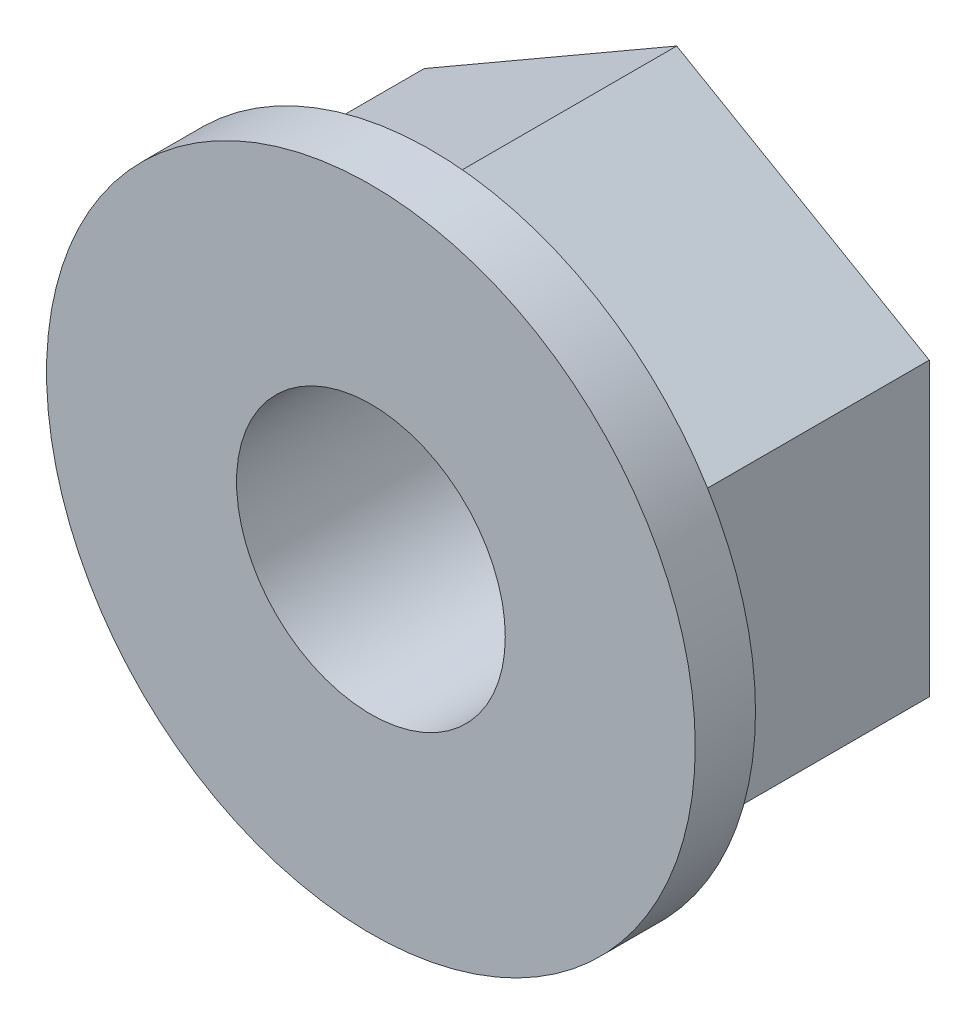
ISO-10303-21;
HEADER;
FILE_DESCRIPTION(('STEP AP214'),'2;1');
FILE_NAME('part.step','',(''),(''),'','','');
FILE_SCHEMA(('AUTOMOTIVE_DESIGN { 1 0 10303 214 1 1 1 1 }'));
ENDSEC;
DATA;
#1=APPLICATION_CONTEXT('core data for automotive mechanical design processes');
#2=APPLICATION_PROTOCOL_DEFINITION('international standard','automotive_design',2000,#1);
#3=PRODUCT_CONTEXT('',#1,'mechanical');
#4=PRODUCT('Part','Part','',(#3));
#5=PRODUCT_RELATED_PRODUCT_CATEGORY('part','',(#4));
#6=PRODUCT_DEFINITION_FORMATION('','',#4);
#7=PRODUCT_DEFINITION_CONTEXT('part definition',#1,'design');
#8=PRODUCT_DEFINITION('design','',#6,#7);
#9=PRODUCT_DEFINITION_SHAPE('','',#8);
#10=(LENGTH_UNIT() NAMED_UNIT(*) SI_UNIT(.MILLI.,.METRE.));
#11=(NAMED_UNIT(*) PLANE_ANGLE_UNIT() SI_UNIT($,.RADIAN.));
#12=(NAMED_UNIT(*) SI_UNIT($,.STERADIAN.) SOLID_ANGLE_UNIT());
#13=UNCERTAINTY_MEASURE_WITH_UNIT(LENGTH_MEASURE(1.E-05),#10,'distance_accuracy_value','');
#14=(GEOMETRIC_REPRESENTATION_CONTEXT(3) GLOBAL_UNCERTAINTY_ASSIGNED_CONTEXT((#13)) GLOBAL_UNIT_ASSIGNED_CONTEXT((#10,
#11,#12)) REPRESENTATION_CONTEXT('',''));
#15=CARTESIAN_POINT('',(0.,0.,0.));
#16=DIRECTION('',(0.,0.,1.));
#17=DIRECTION('',(1.,0.,0.));
#18=AXIS2_PLACEMENT_3D('',#15,#16,#17);
#19=CARTESIAN_POINT('',(5.45,0.,0.));
#20=DIRECTION('',(0.,0.,-1.));
#21=DIRECTION('',(-1.,0.,0.));
#22=AXIS2_PLACEMENT_3D('',#19,#20,#21);
#23=PLANE('',#22);
#24=DIRECTION('',(-0.866025403784439,0.5,0.));
#25=VECTOR('',#24,1.);
#26=CARTESIAN_POINT('',(2.725,1.57327948354173,0.));
#27=LINE('',#26,#25);
#28=CARTESIAN_POINT('',(2.725,1.57327948354173,0.));
#29=VERTEX_POINT('',#28);
#30=CARTESIAN_POINT('',(0.,3.14655896708346,0.));
#31=VERTEX_POINT('',#30);
#32=EDGE_CURVE('E130',#29,#31,#27,.T.);
#33=ORIENTED_EDGE('',*,*,#32,.F.);
#34=DIRECTION('',(0.,1.,0.));
#35=VECTOR('',#34,1.);
#36=CARTESIAN_POINT('',(2.725,-1.57327948354173,0.));
#37=LINE('',#36,#35);
#38=CARTESIAN_POINT('',(2.725,-1.57327948354173,0.));
#39=VERTEX_POINT('',#38);
#40=EDGE_CURVE('E92',#39,#29,#37,.T.);
#41=ORIENTED_EDGE('',*,*,#40,.F.);
#42=DIRECTION('',(0.866025403784439,0.5,0.));
#43=VECTOR('',#42,1.);
#44=CARTESIAN_POINT('',(0.,-3.14655896708346,0.));
#45=LINE('',#44,#43);
#46=CARTESIAN_POINT('',(0.,-3.14655896708346,0.));
#47=VERTEX_POINT('',#46);
#48=EDGE_CURVE('E128',#47,#39,#45,.T.);
#49=ORIENTED_EDGE('',*,*,#48,.F.);
#50=DIRECTION('',(0.866025403784438,-0.5,0.));
#51=VECTOR('',#50,1.);
#52=CARTESIAN_POINT('',(-2.725,-1.57327948354173,0.));
#53=LINE('',#52,#51);
#54=CARTESIAN_POINT('',(-2.725,-1.57327948354173,0.));
#55=VERTEX_POINT('',#54);
#56=EDGE_CURVE('E126',#55,#47,#53,.T.);
#57=ORIENTED_EDGE('',*,*,#56,.F.);
#58=DIRECTION('',(0.,-1.,0.));
#59=VECTOR('',#58,1.);
#60=CARTESIAN_POINT('',(-2.725,1.57327948354173,0.));
#61=LINE('',#60,#59);
#62=CARTESIAN_POINT('',(-2.725,1.57327948354173,0.));
#63=VERTEX_POINT('',#62);
#64=EDGE_CURVE('E117',#63,#55,#61,.T.);
#65=ORIENTED_EDGE('',*,*,#64,.F.);
#66=DIRECTION('',(-0.866025403784439,-0.5,0.));
#67=VECTOR('',#66,1.);
#68=CARTESIAN_POINT('',(0.,3.14655896708346,0.));
#69=LINE('',#68,#67);
#70=EDGE_CURVE('E124',#31,#63,#69,.T.);
#71=ORIENTED_EDGE('',*,*,#70,.F.);
#72=EDGE_LOOP('',(#33,#41,#49,#57,#65,#71));
#73=FACE_BOUND('',#72,.T.);
#74=CARTESIAN_POINT('',(0.,0.,0.));
#75=DIRECTION('',(0.,0.,1.));
#76=DIRECTION('',(1.,0.,0.));
#77=AXIS2_PLACEMENT_3D('',#74,#75,#76);
#78=CIRCLE('',#77,1.45);
#79=CARTESIAN_POINT('',(1.45,0.,0.));
#80=VERTEX_POINT('',#79);
#81=EDGE_CURVE('E139',#80,#80,#78,.T.);
#82=ORIENTED_EDGE('',*,*,#81,.T.);
#83=EDGE_LOOP('',(#82));
#84=FACE_BOUND('',#83,.T.);
#85=ADVANCED_FACE('F28',(#73,#84),#23,.T.);
#86=CARTESIAN_POINT('',(2.725,1.57327948354173,2.65));
#87=DIRECTION('',(-0.5,-0.866025403784439,0.));
#88=DIRECTION('',(0.866025403784439,-0.5,0.));
#89=AXIS2_PLACEMENT_3D('',#86,#87,#88);
#90=PLANE('',#89);
#91=ORIENTED_EDGE('',*,*,#32,.T.);
#92=DIRECTION('',(0.,0.,-1.));
#93=VECTOR('',#92,1.);
#94=CARTESIAN_POINT('',(0.,3.14655896708346,2.65));
#95=LINE('',#94,#93);
#96=CARTESIAN_POINT('',(0.,3.14655896708346,2.65));
#97=VERTEX_POINT('',#96);
#98=EDGE_CURVE('E11',#97,#31,#95,.T.);
#99=ORIENTED_EDGE('',*,*,#98,.F.);
#100=DIRECTION('',(-0.866025403784439,0.5,0.));
#101=VECTOR('',#100,1.);
#102=CARTESIAN_POINT('',(2.725,1.57327948354173,2.65));
#103=LINE('',#102,#101);
#104=CARTESIAN_POINT('',(2.725,1.57327948354173,2.65));
#105=VERTEX_POINT('',#104);
#106=EDGE_CURVE('E83',#105,#97,#103,.T.);
#107=ORIENTED_EDGE('',*,*,#106,.F.);
#108=DIRECTION('',(0.,0.,-1.));
#109=VECTOR('',#108,1.);
#110=CARTESIAN_POINT('',(2.725,1.57327948354173,2.65));
#111=LINE('',#110,#109);
#112=EDGE_CURVE('E86',#105,#29,#111,.T.);
#113=ORIENTED_EDGE('',*,*,#112,.T.);
#114=EDGE_LOOP('',(#91,#99,#107,#113));
#115=FACE_BOUND('',#114,.T.);
#116=ADVANCED_FACE('F30',(#115),#90,.F.);
#117=CARTESIAN_POINT('',(0.,3.14655896708346,2.65));
#118=DIRECTION('',(0.5,-0.866025403784439,0.));
#119=DIRECTION('',(0.866025403784439,0.5,0.));
#120=AXIS2_PLACEMENT_3D('',#117,#118,#119);
#121=PLANE('',#120);
#122=ORIENTED_EDGE('',*,*,#70,.T.);
#123=DIRECTION('',(0.,0.,-1.));
#124=VECTOR('',#123,1.);
#125=CARTESIAN_POINT('',(-2.725,1.57327948354173,2.65));
#126=LINE('',#125,#124);
#127=CARTESIAN_POINT('',(-2.725,1.57327948354173,2.65));
#128=VERTEX_POINT('',#127);
#129=EDGE_CURVE('E36',#128,#63,#126,.T.);
#130=ORIENTED_EDGE('',*,*,#129,.F.);
#131=DIRECTION('',(-0.866025403784439,-0.5,0.));
#132=VECTOR('',#131,1.);
#133=CARTESIAN_POINT('',(0.,3.14655896708346,2.65));
#134=LINE('',#133,#132);
#135=EDGE_CURVE('E91',#97,#128,#134,.T.);
#136=ORIENTED_EDGE('',*,*,#135,.F.);
#137=ORIENTED_EDGE('',*,*,#98,.T.);
#138=EDGE_LOOP('',(#122,#130,#136,#137));
#139=FACE_BOUND('',#138,.T.);
#140=ADVANCED_FACE('F173',(#139),#121,.F.);
#141=CARTESIAN_POINT('',(-2.725,1.57327948354173,2.65));
#142=DIRECTION('',(1.,0.,0.));
#143=DIRECTION('',(0.,1.,0.));
#144=AXIS2_PLACEMENT_3D('',#141,#142,#143);
#145=PLANE('',#144);
#146=ORIENTED_EDGE('',*,*,#64,.T.);
#147=DIRECTION('',(0.,0.,-1.));
#148=VECTOR('',#147,1.);
#149=CARTESIAN_POINT('',(-2.725,-1.57327948354173,2.65));
#150=LINE('',#149,#148);
#151=CARTESIAN_POINT('',(-2.725,-1.57327948354173,2.65));
#152=VERTEX_POINT('',#151);
#153=EDGE_CURVE('E110',#152,#55,#150,.T.);
#154=ORIENTED_EDGE('',*,*,#153,.F.);
#155=DIRECTION('',(0.,-1.,0.));
#156=VECTOR('',#155,1.);
#157=CARTESIAN_POINT('',(-2.725,1.57327948354173,2.65));
#158=LINE('',#157,#156);
#159=EDGE_CURVE('E119',#128,#152,#158,.T.);
#160=ORIENTED_EDGE('',*,*,#159,.F.);
#161=ORIENTED_EDGE('',*,*,#129,.T.);
#162=EDGE_LOOP('',(#146,#154,#160,#161));
#163=FACE_BOUND('',#162,.T.);
#164=ADVANCED_FACE('F116',(#163),#145,.F.);
#165=CARTESIAN_POINT('',(-2.725,-1.57327948354173,2.65));
#166=DIRECTION('',(0.5,0.866025403784438,0.));
#167=DIRECTION('',(-0.866025403784438,0.5,0.));
#168=AXIS2_PLACEMENT_3D('',#165,#166,#167);
#169=PLANE('',#168);
#170=ORIENTED_EDGE('',*,*,#56,.T.);
#171=DIRECTION('',(0.,0.,-1.));
#172=VECTOR('',#171,1.);
#173=CARTESIAN_POINT('',(0.,-3.14655896708346,2.65));
#174=LINE('',#173,#172);
#175=CARTESIAN_POINT('',(0.,-3.14655896708346,2.65));
#176=VERTEX_POINT('',#175);
#177=EDGE_CURVE('E51',#176,#47,#174,.T.);
#178=ORIENTED_EDGE('',*,*,#177,.F.);
#179=DIRECTION('',(0.866025403784438,-0.5,0.));
#180=VECTOR('',#179,1.);
#181=CARTESIAN_POINT('',(-2.725,-1.57327948354173,2.65));
#182=LINE('',#181,#180);
#183=EDGE_CURVE('E104',#152,#176,#182,.T.);
#184=ORIENTED_EDGE('',*,*,#183,.F.);
#185=ORIENTED_EDGE('',*,*,#153,.T.);
#186=EDGE_LOOP('',(#170,#178,#184,#185));
#187=FACE_BOUND('',#186,.T.);
#188=ADVANCED_FACE('F137',(#187),#169,.F.);
#189=CARTESIAN_POINT('',(0.,-3.14655896708346,2.65));
#190=DIRECTION('',(-0.5,0.866025403784439,0.));
#191=DIRECTION('',(-0.866025403784439,-0.5,0.));
#192=AXIS2_PLACEMENT_3D('',#189,#190,#191);
#193=PLANE('',#192);
#194=ORIENTED_EDGE('',*,*,#48,.T.);
#195=DIRECTION('',(0.,0.,-1.));
#196=VECTOR('',#195,1.);
#197=CARTESIAN_POINT('',(2.725,-1.57327948354173,2.65));
#198=LINE('',#197,#196);
#199=CARTESIAN_POINT('',(2.725,-1.57327948354173,2.65));
#200=VERTEX_POINT('',#199);
#201=EDGE_CURVE('E43',#200,#39,#198,.T.);
#202=ORIENTED_EDGE('',*,*,#201,.F.);
#203=DIRECTION('',(0.866025403784439,0.5,0.));
#204=VECTOR('',#203,1.);
#205=CARTESIAN_POINT('',(0.,-3.14655896708346,2.65));
#206=LINE('',#205,#204);
#207=EDGE_CURVE('E102',#176,#200,#206,.T.);
#208=ORIENTED_EDGE('',*,*,#207,.F.);
#209=ORIENTED_EDGE('',*,*,#177,.T.);
#210=EDGE_LOOP('',(#194,#202,#208,#209));
#211=FACE_BOUND('',#210,.T.);
#212=ADVANCED_FACE('F138',(#211),#193,.F.);
#213=CARTESIAN_POINT('',(2.725,-1.57327948354173,2.65));
#214=DIRECTION('',(-1.,0.,0.));
#215=DIRECTION('',(0.,0.,1.));
#216=AXIS2_PLACEMENT_3D('',#213,#214,#215);
#217=PLANE('',#216);
#218=ORIENTED_EDGE('',*,*,#40,.T.);
#219=ORIENTED_EDGE('',*,*,#112,.F.);
#220=DIRECTION('',(0.,1.,0.));
#221=VECTOR('',#220,1.);
#222=CARTESIAN_POINT('',(2.725,-1.57327948354173,2.65));
#223=LINE('',#222,#221);
#224=EDGE_CURVE('E96',#200,#105,#223,.T.);
#225=ORIENTED_EDGE('',*,*,#224,.F.);
#226=ORIENTED_EDGE('',*,*,#201,.T.);
#227=EDGE_LOOP('',(#218,#219,#225,#226));
#228=FACE_BOUND('',#227,.T.);
#229=ADVANCED_FACE('F95',(#228),#217,.F.);
#230=CARTESIAN_POINT('',(0.,0.,2.65));
#231=DIRECTION('',(0.,0.,-1.));
#232=DIRECTION('',(-1.,0.,0.));
#233=AXIS2_PLACEMENT_3D('',#230,#231,#232);
#234=CYLINDRICAL_SURFACE('',#233,1.45);
#235=ORIENTED_EDGE('',*,*,#81,.F.);
#236=EDGE_LOOP('',(#235));
#237=FACE_BOUND('',#236,.T.);
#238=CARTESIAN_POINT('',(0.,0.,3.3));
#239=DIRECTION('',(0.,0.,1.));
#240=DIRECTION('',(1.,0.,0.));
#241=AXIS2_PLACEMENT_3D('',#238,#239,#240);
#242=CIRCLE('',#241,1.45);
#243=CARTESIAN_POINT('',(1.45,0.,3.3));
#244=VERTEX_POINT('',#243);
#245=EDGE_CURVE('E149',#244,#244,#242,.T.);
#246=ORIENTED_EDGE('',*,*,#245,.T.);
#247=EDGE_LOOP('',(#246));
#248=FACE_BOUND('',#247,.T.);
#249=ADVANCED_FACE('F153',(#237,#248),#234,.F.);
#250=CARTESIAN_POINT('',(0.,0.,2.65));
#251=DIRECTION('',(0.,0.,1.));
#252=DIRECTION('',(1.,0.,0.));
#253=AXIS2_PLACEMENT_3D('',#250,#251,#252);
#254=PLANE('',#253);
#255=CARTESIAN_POINT('',(0.,0.,2.65));
#256=DIRECTION('',(0.,0.,1.));
#257=DIRECTION('',(1.,0.,0.));
#258=AXIS2_PLACEMENT_3D('',#255,#256,#257);
#259=CIRCLE('',#258,3.5);
#260=CARTESIAN_POINT('',(3.5,0.,2.65));
#261=VERTEX_POINT('',#260);
#262=EDGE_CURVE('E146',#261,#261,#259,.T.);
#263=ORIENTED_EDGE('',*,*,#262,.F.);
#264=EDGE_LOOP('',(#263));
#265=FACE_BOUND('',#264,.T.);
#266=ORIENTED_EDGE('',*,*,#224,.T.);
#267=ORIENTED_EDGE('',*,*,#106,.T.);
#268=ORIENTED_EDGE('',*,*,#135,.T.);
#269=ORIENTED_EDGE('',*,*,#159,.T.);
#270=ORIENTED_EDGE('',*,*,#183,.T.);
#271=ORIENTED_EDGE('',*,*,#207,.T.);
#272=EDGE_LOOP('',(#266,#267,#268,#269,#270,#271));
#273=FACE_BOUND('',#272,.T.);
#274=ADVANCED_FACE('F100',(#265,#273),#254,.F.);
#275=CARTESIAN_POINT('',(0.,0.,3.3));
#276=DIRECTION('',(0.,0.,1.));
#277=DIRECTION('',(1.,0.,0.));
#278=AXIS2_PLACEMENT_3D('',#275,#276,#277);
#279=PLANE('',#278);
#280=CARTESIAN_POINT('',(0.,0.,3.3));
#281=DIRECTION('',(0.,0.,1.));
#282=DIRECTION('',(1.,0.,0.));
#283=AXIS2_PLACEMENT_3D('',#280,#281,#282);
#284=CIRCLE('',#283,3.5);
#285=CARTESIAN_POINT('',(3.5,0.,3.3));
#286=VERTEX_POINT('',#285);
#287=EDGE_CURVE('E141',#286,#286,#284,.T.);
#288=ORIENTED_EDGE('',*,*,#287,.T.);
#289=EDGE_LOOP('',(#288));
#290=FACE_BOUND('',#289,.T.);
#291=ORIENTED_EDGE('',*,*,#245,.F.);
#292=EDGE_LOOP('',(#291));
#293=FACE_BOUND('',#292,.T.);
#294=ADVANCED_FACE('F155',(#290,#293),#279,.T.);
#295=CARTESIAN_POINT('',(0.,0.,3.3));
#296=DIRECTION('',(0.,0.,-1.));
#297=DIRECTION('',(-1.,0.,0.));
#298=AXIS2_PLACEMENT_3D('',#295,#296,#297);
#299=CYLINDRICAL_SURFACE('',#298,3.5);
#300=ORIENTED_EDGE('',*,*,#287,.F.);
#301=EDGE_LOOP('',(#300));
#302=FACE_BOUND('',#301,.T.);
#303=ORIENTED_EDGE('',*,*,#262,.T.);
#304=EDGE_LOOP('',(#303));
#305=FACE_BOUND('',#304,.T.);
#306=ADVANCED_FACE('F157',(#302,#305),#299,.T.);
#307=CLOSED_SHELL('',(#85,#116,#140,#164,#188,#212,#229,#249,#274,#294,#306));
#308=MANIFOLD_SOLID_BREP('B2',#307);
#309=ADVANCED_BREP_SHAPE_REPRESENTATION('',(#18,#308),#14);
#310=SHAPE_DEFINITION_REPRESENTATION(#9,#309);
ENDSEC;
END-ISO-10303-21;
